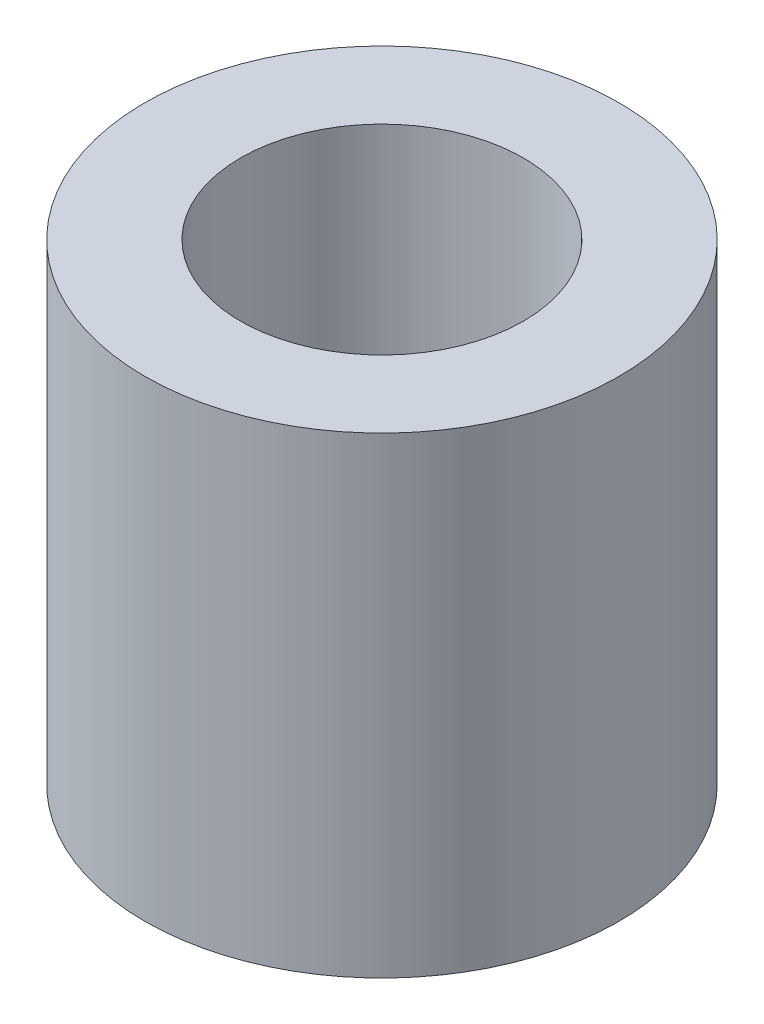
ISO-10303-21;
HEADER;
FILE_DESCRIPTION(('STEP AP214'),'2;1');
FILE_NAME('part.step','',(''),(''),'','','');
FILE_SCHEMA(('AUTOMOTIVE_DESIGN { 1 0 10303 214 1 1 1 1 }'));
ENDSEC;
DATA;
#1=APPLICATION_CONTEXT('core data for automotive mechanical design processes');
#2=APPLICATION_PROTOCOL_DEFINITION('international standard','automotive_design',2000,#1);
#3=PRODUCT_CONTEXT('',#1,'mechanical');
#4=PRODUCT('Part','Part','',(#3));
#5=PRODUCT_RELATED_PRODUCT_CATEGORY('part','',(#4));
#6=PRODUCT_DEFINITION_FORMATION('','',#4);
#7=PRODUCT_DEFINITION_CONTEXT('part definition',#1,'design');
#8=PRODUCT_DEFINITION('design','',#6,#7);
#9=PRODUCT_DEFINITION_SHAPE('','',#8);
#10=(LENGTH_UNIT() NAMED_UNIT(*) SI_UNIT(.MILLI.,.METRE.));
#11=(NAMED_UNIT(*) PLANE_ANGLE_UNIT() SI_UNIT($,.RADIAN.));
#12=(NAMED_UNIT(*) SI_UNIT($,.STERADIAN.) SOLID_ANGLE_UNIT());
#13=UNCERTAINTY_MEASURE_WITH_UNIT(LENGTH_MEASURE(1.E-05),#10,'distance_accuracy_value','');
#14=(GEOMETRIC_REPRESENTATION_CONTEXT(3) GLOBAL_UNCERTAINTY_ASSIGNED_CONTEXT((#13)) GLOBAL_UNIT_ASSIGNED_CONTEXT((#10,
#11,#12)) REPRESENTATION_CONTEXT('',''));
#15=CARTESIAN_POINT('',(0.,0.,0.));
#16=DIRECTION('',(0.,0.,1.));
#17=DIRECTION('',(1.,0.,0.));
#18=AXIS2_PLACEMENT_3D('',#15,#16,#17);
#19=CARTESIAN_POINT('',(0.,29.86278,0.));
#20=DIRECTION('',(0.,1.,0.));
#21=DIRECTION('',(0.,0.,1.));
#22=AXIS2_PLACEMENT_3D('',#19,#20,#21);
#23=PLANE('',#22);
#24=CARTESIAN_POINT('',(0.,29.86278,0.));
#25=DIRECTION('',(0.,1.,0.));
#26=DIRECTION('',(0.,0.,1.));
#27=AXIS2_PLACEMENT_3D('',#24,#25,#26);
#28=CIRCLE('',#27,14.99997);
#29=CARTESIAN_POINT('',(0.,29.86278,14.99997));
#30=VERTEX_POINT('',#29);
#31=EDGE_CURVE('E11',#30,#30,#28,.T.);
#32=ORIENTED_EDGE('',*,*,#31,.T.);
#33=EDGE_LOOP('',(#32));
#34=FACE_BOUND('',#33,.T.);
#35=CARTESIAN_POINT('',(0.,29.86278,0.));
#36=DIRECTION('',(0.,1.,0.));
#37=DIRECTION('',(1.,0.,0.));
#38=AXIS2_PLACEMENT_3D('',#35,#36,#37);
#39=CIRCLE('',#38,8.94969);
#40=CARTESIAN_POINT('',(8.94969,29.86278,0.));
#41=VERTEX_POINT('',#40);
#42=EDGE_CURVE('E49',#41,#41,#39,.T.);
#43=ORIENTED_EDGE('',*,*,#42,.F.);
#44=EDGE_LOOP('',(#43));
#45=FACE_BOUND('',#44,.T.);
#46=ADVANCED_FACE('F38',(#34,#45),#23,.T.);
#47=CARTESIAN_POINT('',(0.,0.,0.));
#48=DIRECTION('',(0.,1.,0.));
#49=DIRECTION('',(0.,0.,1.));
#50=AXIS2_PLACEMENT_3D('',#47,#48,#49);
#51=PLANE('',#50);
#52=CARTESIAN_POINT('',(0.,0.,0.));
#53=DIRECTION('',(0.,1.,0.));
#54=DIRECTION('',(0.,0.,1.));
#55=AXIS2_PLACEMENT_3D('',#52,#53,#54);
#56=CIRCLE('',#55,14.99997);
#57=CARTESIAN_POINT('',(0.,0.,14.99997));
#58=VERTEX_POINT('',#57);
#59=EDGE_CURVE('E42',#58,#58,#56,.T.);
#60=ORIENTED_EDGE('',*,*,#59,.F.);
#61=EDGE_LOOP('',(#60));
#62=FACE_BOUND('',#61,.T.);
#63=CARTESIAN_POINT('',(0.,0.,0.));
#64=DIRECTION('',(0.,1.,0.));
#65=DIRECTION('',(1.,0.,0.));
#66=AXIS2_PLACEMENT_3D('',#63,#64,#65);
#67=CIRCLE('',#66,8.94969);
#68=CARTESIAN_POINT('',(8.94969,0.,0.));
#69=VERTEX_POINT('',#68);
#70=EDGE_CURVE('E51',#69,#69,#67,.T.);
#71=ORIENTED_EDGE('',*,*,#70,.T.);
#72=EDGE_LOOP('',(#71));
#73=FACE_BOUND('',#72,.T.);
#74=ADVANCED_FACE('F61',(#62,#73),#51,.F.);
#75=CARTESIAN_POINT('',(0.,29.86278,0.));
#76=DIRECTION('',(0.,-1.,0.));
#77=DIRECTION('',(0.,0.,-1.));
#78=AXIS2_PLACEMENT_3D('',#75,#76,#77);
#79=CYLINDRICAL_SURFACE('',#78,14.99997);
#80=ORIENTED_EDGE('',*,*,#31,.F.);
#81=EDGE_LOOP('',(#80));
#82=FACE_BOUND('',#81,.T.);
#83=ORIENTED_EDGE('',*,*,#59,.T.);
#84=EDGE_LOOP('',(#83));
#85=FACE_BOUND('',#84,.T.);
#86=ADVANCED_FACE('F40',(#82,#85),#79,.T.);
#87=CARTESIAN_POINT('',(0.,29.86278,0.));
#88=DIRECTION('',(0.,-1.,0.));
#89=DIRECTION('',(0.,0.,-1.));
#90=AXIS2_PLACEMENT_3D('',#87,#88,#89);
#91=CYLINDRICAL_SURFACE('',#90,8.94969);
#92=ORIENTED_EDGE('',*,*,#42,.T.);
#93=EDGE_LOOP('',(#92));
#94=FACE_BOUND('',#93,.T.);
#95=ORIENTED_EDGE('',*,*,#70,.F.);
#96=EDGE_LOOP('',(#95));
#97=FACE_BOUND('',#96,.T.);
#98=ADVANCED_FACE('F57',(#94,#97),#91,.F.);
#99=CLOSED_SHELL('',(#46,#74,#86,#98));
#100=MANIFOLD_SOLID_BREP('B2',#99);
#101=ADVANCED_BREP_SHAPE_REPRESENTATION('',(#18,#100),#14);
#102=SHAPE_DEFINITION_REPRESENTATION(#9,#101);
ENDSEC;
END-ISO-10303-21;
